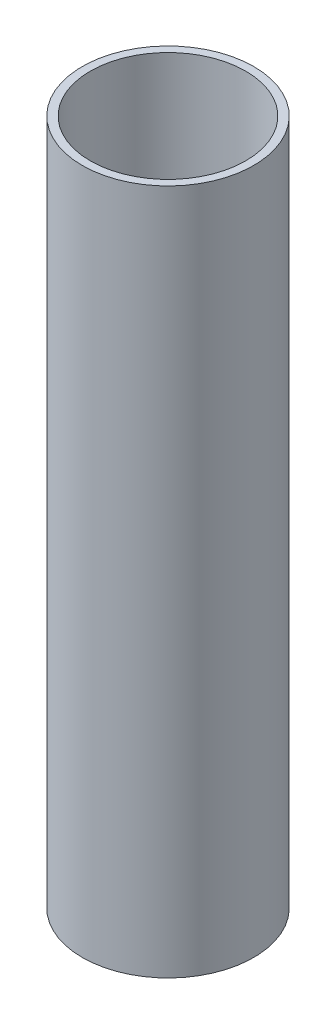
ISO-10303-21;
HEADER;
FILE_DESCRIPTION(('STEP AP214'),'2;1');
FILE_NAME('part.step','',(''),(''),'','','');
FILE_SCHEMA(('AUTOMOTIVE_DESIGN { 1 0 10303 214 1 1 1 1 }'));
ENDSEC;
DATA;
#1=APPLICATION_CONTEXT('core data for automotive mechanical design processes');
#2=APPLICATION_PROTOCOL_DEFINITION('international standard','automotive_design',2000,#1);
#3=PRODUCT_CONTEXT('',#1,'mechanical');
#4=PRODUCT('Part','Part','',(#3));
#5=PRODUCT_RELATED_PRODUCT_CATEGORY('part','',(#4));
#6=PRODUCT_DEFINITION_FORMATION('','',#4);
#7=PRODUCT_DEFINITION_CONTEXT('part definition',#1,'design');
#8=PRODUCT_DEFINITION('design','',#6,#7);
#9=PRODUCT_DEFINITION_SHAPE('','',#8);
#10=(LENGTH_UNIT() NAMED_UNIT(*) SI_UNIT(.MILLI.,.METRE.));
#11=(NAMED_UNIT(*) PLANE_ANGLE_UNIT() SI_UNIT($,.RADIAN.));
#12=(NAMED_UNIT(*) SI_UNIT($,.STERADIAN.) SOLID_ANGLE_UNIT());
#13=UNCERTAINTY_MEASURE_WITH_UNIT(LENGTH_MEASURE(1.E-05),#10,'distance_accuracy_value','');
#14=(GEOMETRIC_REPRESENTATION_CONTEXT(3) GLOBAL_UNCERTAINTY_ASSIGNED_CONTEXT((#13)) GLOBAL_UNIT_ASSIGNED_CONTEXT((#10,
#11,#12)) REPRESENTATION_CONTEXT('',''));
#15=CARTESIAN_POINT('',(0.,0.,0.));
#16=DIRECTION('',(0.,0.,1.));
#17=DIRECTION('',(1.,0.,0.));
#18=AXIS2_PLACEMENT_3D('',#15,#16,#17);
#19=CARTESIAN_POINT('',(0.,38.1,0.));
#20=DIRECTION('',(0.,1.,0.));
#21=DIRECTION('',(0.,0.,1.));
#22=AXIS2_PLACEMENT_3D('',#19,#20,#21);
#23=PLANE('',#22);
#24=CARTESIAN_POINT('',(0.,38.1,0.));
#25=DIRECTION('',(0.,1.,0.));
#26=DIRECTION('',(0.,0.,1.));
#27=AXIS2_PLACEMENT_3D('',#24,#25,#26);
#28=CIRCLE('',#27,9.525);
#29=CARTESIAN_POINT('',(0.,38.1,9.525));
#30=VERTEX_POINT('',#29);
#31=EDGE_CURVE('E10',#30,#30,#28,.T.);
#32=ORIENTED_EDGE('',*,*,#31,.T.);
#33=EDGE_LOOP('',(#32));
#34=FACE_BOUND('',#33,.T.);
#35=CARTESIAN_POINT('',(0.,38.1,0.));
#36=DIRECTION('',(0.,1.,0.));
#37=DIRECTION('',(0.,0.,1.));
#38=AXIS2_PLACEMENT_3D('',#35,#36,#37);
#39=CIRCLE('',#38,8.636);
#40=CARTESIAN_POINT('',(0.,38.1,8.636));
#41=VERTEX_POINT('',#40);
#42=EDGE_CURVE('E46',#41,#41,#39,.T.);
#43=ORIENTED_EDGE('',*,*,#42,.F.);
#44=EDGE_LOOP('',(#43));
#45=FACE_BOUND('',#44,.T.);
#46=ADVANCED_FACE('F34',(#34,#45),#23,.T.);
#47=CARTESIAN_POINT('',(0.,-38.1,0.));
#48=DIRECTION('',(0.,1.,0.));
#49=DIRECTION('',(0.,0.,1.));
#50=AXIS2_PLACEMENT_3D('',#47,#48,#49);
#51=PLANE('',#50);
#52=CARTESIAN_POINT('',(0.,-38.1,0.));
#53=DIRECTION('',(0.,1.,0.));
#54=DIRECTION('',(0.,0.,1.));
#55=AXIS2_PLACEMENT_3D('',#52,#53,#54);
#56=CIRCLE('',#55,9.525);
#57=CARTESIAN_POINT('',(0.,-38.1,9.525));
#58=VERTEX_POINT('',#57);
#59=EDGE_CURVE('E38',#58,#58,#56,.T.);
#60=ORIENTED_EDGE('',*,*,#59,.F.);
#61=EDGE_LOOP('',(#60));
#62=FACE_BOUND('',#61,.T.);
#63=CARTESIAN_POINT('',(0.,-38.1,0.));
#64=DIRECTION('',(0.,1.,0.));
#65=DIRECTION('',(0.,0.,1.));
#66=AXIS2_PLACEMENT_3D('',#63,#64,#65);
#67=CIRCLE('',#66,8.636);
#68=CARTESIAN_POINT('',(0.,-38.1,8.636));
#69=VERTEX_POINT('',#68);
#70=EDGE_CURVE('E48',#69,#69,#67,.T.);
#71=ORIENTED_EDGE('',*,*,#70,.T.);
#72=EDGE_LOOP('',(#71));
#73=FACE_BOUND('',#72,.T.);
#74=ADVANCED_FACE('F59',(#62,#73),#51,.F.);
#75=CARTESIAN_POINT('',(0.,38.1,0.));
#76=DIRECTION('',(0.,-1.,0.));
#77=DIRECTION('',(0.,0.,-1.));
#78=AXIS2_PLACEMENT_3D('',#75,#76,#77);
#79=CYLINDRICAL_SURFACE('',#78,9.525);
#80=ORIENTED_EDGE('',*,*,#31,.F.);
#81=EDGE_LOOP('',(#80));
#82=FACE_BOUND('',#81,.T.);
#83=ORIENTED_EDGE('',*,*,#59,.T.);
#84=EDGE_LOOP('',(#83));
#85=FACE_BOUND('',#84,.T.);
#86=ADVANCED_FACE('F36',(#82,#85),#79,.T.);
#87=CARTESIAN_POINT('',(0.,38.1,0.));
#88=DIRECTION('',(0.,-1.,0.));
#89=DIRECTION('',(0.,0.,-1.));
#90=AXIS2_PLACEMENT_3D('',#87,#88,#89);
#91=CYLINDRICAL_SURFACE('',#90,8.636);
#92=ORIENTED_EDGE('',*,*,#42,.T.);
#93=EDGE_LOOP('',(#92));
#94=FACE_BOUND('',#93,.T.);
#95=ORIENTED_EDGE('',*,*,#70,.F.);
#96=EDGE_LOOP('',(#95));
#97=FACE_BOUND('',#96,.T.);
#98=ADVANCED_FACE('F55',(#94,#97),#91,.F.);
#99=CLOSED_SHELL('',(#46,#74,#86,#98));
#100=MANIFOLD_SOLID_BREP('B2',#99);
#101=ADVANCED_BREP_SHAPE_REPRESENTATION('',(#18,#100),#14);
#102=SHAPE_DEFINITION_REPRESENTATION(#9,#101);
ENDSEC;
END-ISO-10303-21;
